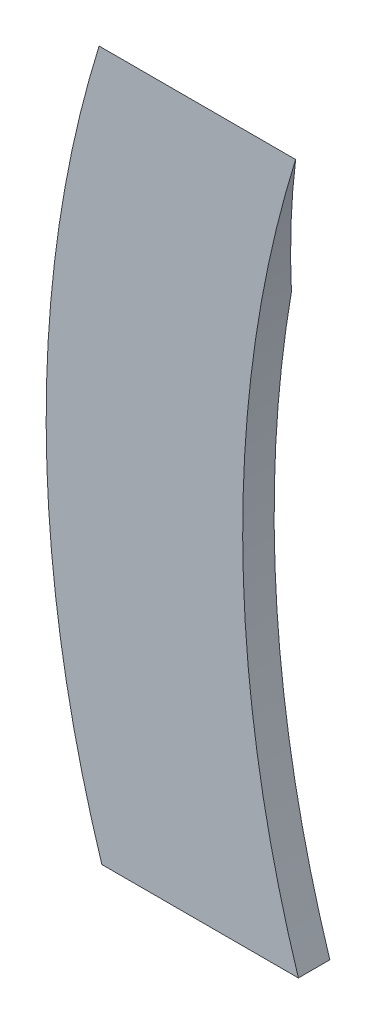
ISO-10303-21;
HEADER;
FILE_DESCRIPTION(('STEP AP214'),'2;1');
FILE_NAME('part.step','',(''),(''),'','','');
FILE_SCHEMA(('AUTOMOTIVE_DESIGN { 1 0 10303 214 1 1 1 1 }'));
ENDSEC;
DATA;
#1=APPLICATION_CONTEXT('core data for automotive mechanical design processes');
#2=APPLICATION_PROTOCOL_DEFINITION('international standard','automotive_design',2000,#1);
#3=PRODUCT_CONTEXT('',#1,'mechanical');
#4=PRODUCT('Part','Part','',(#3));
#5=PRODUCT_RELATED_PRODUCT_CATEGORY('part','',(#4));
#6=PRODUCT_DEFINITION_FORMATION('','',#4);
#7=PRODUCT_DEFINITION_CONTEXT('part definition',#1,'design');
#8=PRODUCT_DEFINITION('design','',#6,#7);
#9=PRODUCT_DEFINITION_SHAPE('','',#8);
#10=(LENGTH_UNIT() NAMED_UNIT(*) SI_UNIT(.MILLI.,.METRE.));
#11=(NAMED_UNIT(*) PLANE_ANGLE_UNIT() SI_UNIT($,.RADIAN.));
#12=(NAMED_UNIT(*) SI_UNIT($,.STERADIAN.) SOLID_ANGLE_UNIT());
#13=UNCERTAINTY_MEASURE_WITH_UNIT(LENGTH_MEASURE(1.E-05),#10,'distance_accuracy_value','');
#14=(GEOMETRIC_REPRESENTATION_CONTEXT(3) GLOBAL_UNCERTAINTY_ASSIGNED_CONTEXT((#13)) GLOBAL_UNIT_ASSIGNED_CONTEXT((#10,
#11,#12)) REPRESENTATION_CONTEXT('',''));
#15=CARTESIAN_POINT('',(0.,0.,0.));
#16=DIRECTION('',(0.,0.,1.));
#17=DIRECTION('',(1.,0.,0.));
#18=AXIS2_PLACEMENT_3D('',#15,#16,#17);
#19=CARTESIAN_POINT('',(142.914429491909,45.5572809000085,4.));
#20=DIRECTION('',(0.,0.,-1.));
#21=DIRECTION('',(-1.,0.,0.));
#22=AXIS2_PLACEMENT_3D('',#19,#20,#21);
#23=CYLINDRICAL_SURFACE('',#22,150.);
#24=CARTESIAN_POINT('',(142.914429491909,45.5572809000085,4.));
#25=DIRECTION('',(0.,0.,1.));
#26=DIRECTION('',(-1.,0.,0.));
#27=AXIS2_PLACEMENT_3D('',#24,#25,#26);
#28=CIRCLE('',#27,150.);
#29=CARTESIAN_POINT('',(-0.350516391581096,90.,4.));
#30=VERTEX_POINT('',#29);
#31=CARTESIAN_POINT('',(0.,0.,4.));
#32=VERTEX_POINT('',#31);
#33=EDGE_CURVE('E130',#30,#32,#28,.T.);
#34=ORIENTED_EDGE('',*,*,#33,.F.);
#35=CARTESIAN_POINT('',(142.914429491909,45.5572809000085,-5.44659156316052));
#36=DIRECTION('',(0.,-0.207911690817753,0.978147600733807));
#37=DIRECTION('',(0.,-0.978147600733807,-0.207911690817753));
#38=AXIS2_PLACEMENT_3D('',#35,#36,#37);
#39=ELLIPSE('',#38,153.351089229754,150.);
#40=CARTESIAN_POINT('',(-4.88070047835257,71.1814795620856,0.));
#41=VERTEX_POINT('',#40);
#42=EDGE_CURVE('E121',#30,#41,#39,.T.);
#43=ORIENTED_EDGE('',*,*,#42,.T.);
#44=CARTESIAN_POINT('',(142.914429491909,45.5572809000085,0.));
#45=DIRECTION('',(0.,0.,1.));
#46=DIRECTION('',(-1.,0.,0.));
#47=AXIS2_PLACEMENT_3D('',#44,#45,#46);
#48=CIRCLE('',#47,150.);
#49=CARTESIAN_POINT('',(0.,0.,0.));
#50=VERTEX_POINT('',#49);
#51=EDGE_CURVE('E129',#41,#50,#48,.T.);
#52=ORIENTED_EDGE('',*,*,#51,.T.);
#53=DIRECTION('',(0.,0.,-1.));
#54=VECTOR('',#53,1.);
#55=CARTESIAN_POINT('',(0.,0.,4.));
#56=LINE('',#55,#54);
#57=EDGE_CURVE('E150',#32,#50,#56,.T.);
#58=ORIENTED_EDGE('',*,*,#57,.F.);
#59=EDGE_LOOP('',(#34,#43,#52,#58));
#60=FACE_BOUND('',#59,.T.);
#61=CARTESIAN_POINT('',(142.914429491909,45.5572809000085,0.999999999999997));
#62=DIRECTION('',(0.,0.,1.));
#63=DIRECTION('',(0.,-1.,0.));
#64=AXIS2_PLACEMENT_3D('',#61,#62,#63);
#65=CIRCLE('',#64,150.);
#66=CARTESIAN_POINT('',(-5.08068354564714,70.,1.));
#67=VERTEX_POINT('',#66);
#68=CARTESIAN_POINT('',(-4.89228684059795,20.,0.999999999999994));
#69=VERTEX_POINT('',#68);
#70=EDGE_CURVE('E155',#67,#69,#65,.T.);
#71=ORIENTED_EDGE('',*,*,#70,.F.);
#72=DIRECTION('',(0.,0.,-1.));
#73=VECTOR('',#72,1.);
#74=CARTESIAN_POINT('',(-5.08068354564714,70.,4.));
#75=LINE('',#74,#73);
#76=CARTESIAN_POINT('',(-5.08068354564714,70.,3.));
#77=VERTEX_POINT('',#76);
#78=EDGE_CURVE('E11',#77,#67,#75,.T.);
#79=ORIENTED_EDGE('',*,*,#78,.F.);
#80=CARTESIAN_POINT('',(142.914429491909,45.5572809000085,3.));
#81=DIRECTION('',(0.,0.,-1.));
#82=DIRECTION('',(-1.,0.,0.));
#83=AXIS2_PLACEMENT_3D('',#80,#81,#82);
#84=CIRCLE('',#83,150.);
#85=CARTESIAN_POINT('',(-4.89228684059795,20.,3.));
#86=VERTEX_POINT('',#85);
#87=EDGE_CURVE('E43',#86,#77,#84,.T.);
#88=ORIENTED_EDGE('',*,*,#87,.F.);
#89=DIRECTION('',(0.,0.,-1.));
#90=VECTOR('',#89,1.);
#91=CARTESIAN_POINT('',(-4.89228684059795,20.,4.));
#92=LINE('',#91,#90);
#93=EDGE_CURVE('E118',#69,#86,#92,.F.);
#94=ORIENTED_EDGE('',*,*,#93,.F.);
#95=EDGE_LOOP('',(#71,#79,#88,#94));
#96=FACE_BOUND('',#95,.T.);
#97=ADVANCED_FACE('F36',(#60,#96),#23,.T.);
#98=CARTESIAN_POINT('',(0.,0.,4.));
#99=DIRECTION('',(0.,1.,0.));
#100=DIRECTION('',(0.,0.,1.));
#101=AXIS2_PLACEMENT_3D('',#98,#99,#100);
#102=PLANE('',#101);
#103=DIRECTION('',(1.,0.,0.));
#104=VECTOR('',#103,1.);
#105=CARTESIAN_POINT('',(0.,0.,0.));
#106=LINE('',#105,#104);
#107=CARTESIAN_POINT('',(25.,0.,0.));
#108=VERTEX_POINT('',#107);
#109=EDGE_CURVE('E144',#50,#108,#106,.T.);
#110=ORIENTED_EDGE('',*,*,#109,.T.);
#111=DIRECTION('',(0.,0.,-1.));
#112=VECTOR('',#111,1.);
#113=CARTESIAN_POINT('',(25.,0.,4.));
#114=LINE('',#113,#112);
#115=CARTESIAN_POINT('',(25.,0.,4.));
#116=VERTEX_POINT('',#115);
#117=EDGE_CURVE('E142',#116,#108,#114,.T.);
#118=ORIENTED_EDGE('',*,*,#117,.F.);
#119=DIRECTION('',(1.,0.,0.));
#120=VECTOR('',#119,1.);
#121=CARTESIAN_POINT('',(0.,0.,4.));
#122=LINE('',#121,#120);
#123=EDGE_CURVE('E133',#32,#116,#122,.T.);
#124=ORIENTED_EDGE('',*,*,#123,.F.);
#125=ORIENTED_EDGE('',*,*,#57,.T.);
#126=EDGE_LOOP('',(#110,#118,#124,#125));
#127=FACE_BOUND('',#126,.T.);
#128=ADVANCED_FACE('F178',(#127),#102,.F.);
#129=CARTESIAN_POINT('',(167.914429491909,45.5572809000085,4.));
#130=DIRECTION('',(0.,0.,-1.));
#131=DIRECTION('',(-1.,0.,0.));
#132=AXIS2_PLACEMENT_3D('',#129,#130,#131);
#133=CYLINDRICAL_SURFACE('',#132,150.);
#134=CARTESIAN_POINT('',(167.914429491909,45.5572809000085,0.));
#135=DIRECTION('',(0.,0.,-1.));
#136=DIRECTION('',(1.,0.,0.));
#137=AXIS2_PLACEMENT_3D('',#134,#135,#136);
#138=CIRCLE('',#137,150.);
#139=CARTESIAN_POINT('',(20.1192995216474,71.1814795620856,0.));
#140=VERTEX_POINT('',#139);
#141=EDGE_CURVE('E134',#108,#140,#138,.T.);
#142=ORIENTED_EDGE('',*,*,#141,.T.);
#143=CARTESIAN_POINT('',(167.914429491909,45.5572809000085,-5.44659156316052));
#144=DIRECTION('',(0.,-0.207911690817753,0.978147600733807));
#145=DIRECTION('',(0.,-0.978147600733807,-0.207911690817753));
#146=AXIS2_PLACEMENT_3D('',#143,#144,#145);
#147=ELLIPSE('',#146,153.351089229754,150.);
#148=CARTESIAN_POINT('',(24.6494836084189,90.,4.));
#149=VERTEX_POINT('',#148);
#150=EDGE_CURVE('E57',#140,#149,#147,.F.);
#151=ORIENTED_EDGE('',*,*,#150,.T.);
#152=CARTESIAN_POINT('',(167.914429491909,45.5572809000085,4.));
#153=DIRECTION('',(0.,0.,-1.));
#154=DIRECTION('',(1.,0.,0.));
#155=AXIS2_PLACEMENT_3D('',#152,#153,#154);
#156=CIRCLE('',#155,150.);
#157=EDGE_CURVE('E136',#116,#149,#156,.T.);
#158=ORIENTED_EDGE('',*,*,#157,.F.);
#159=ORIENTED_EDGE('',*,*,#117,.T.);
#160=EDGE_LOOP('',(#142,#151,#158,#159));
#161=FACE_BOUND('',#160,.T.);
#162=ADVANCED_FACE('F183',(#161),#133,.F.);
#163=CARTESIAN_POINT('',(142.914429491909,45.5572809000085,4.));
#164=DIRECTION('',(0.,0.,-1.));
#165=DIRECTION('',(-1.,0.,0.));
#166=AXIS2_PLACEMENT_3D('',#163,#164,#165);
#167=PLANE('',#166);
#168=ORIENTED_EDGE('',*,*,#33,.T.);
#169=ORIENTED_EDGE('',*,*,#123,.T.);
#170=ORIENTED_EDGE('',*,*,#157,.T.);
#171=DIRECTION('',(-1.,0.,0.));
#172=VECTOR('',#171,1.);
#173=CARTESIAN_POINT('',(-0.350516391581124,90.,4.));
#174=LINE('',#173,#172);
#175=EDGE_CURVE('E139',#149,#30,#174,.T.);
#176=ORIENTED_EDGE('',*,*,#175,.T.);
#177=EDGE_LOOP('',(#168,#169,#170,#176));
#178=FACE_BOUND('',#177,.T.);
#179=ADVANCED_FACE('F189',(#178),#167,.F.);
#180=CARTESIAN_POINT('',(142.914429491909,45.5572809000085,0.));
#181=DIRECTION('',(0.,0.,-1.));
#182=DIRECTION('',(-1.,0.,0.));
#183=AXIS2_PLACEMENT_3D('',#180,#181,#182);
#184=PLANE('',#183);
#185=DIRECTION('',(-1.,0.,0.));
#186=VECTOR('',#185,1.);
#187=CARTESIAN_POINT('',(142.914429491909,71.1814795620856,0.));
#188=LINE('',#187,#186);
#189=EDGE_CURVE('E153',#140,#41,#188,.T.);
#190=ORIENTED_EDGE('',*,*,#189,.F.);
#191=ORIENTED_EDGE('',*,*,#141,.F.);
#192=ORIENTED_EDGE('',*,*,#109,.F.);
#193=ORIENTED_EDGE('',*,*,#51,.F.);
#194=EDGE_LOOP('',(#190,#191,#192,#193));
#195=FACE_BOUND('',#194,.T.);
#196=ADVANCED_FACE('F197',(#195),#184,.T.);
#197=CARTESIAN_POINT('',(-7.08557050809139,90.,4.));
#198=DIRECTION('',(0.,-0.207911690817753,0.978147600733807));
#199=DIRECTION('',(0.,-0.978147600733807,-0.207911690817753));
#200=AXIS2_PLACEMENT_3D('',#197,#198,#199);
#201=PLANE('',#200);
#202=ORIENTED_EDGE('',*,*,#175,.F.);
#203=ORIENTED_EDGE('',*,*,#150,.F.);
#204=ORIENTED_EDGE('',*,*,#189,.T.);
#205=ORIENTED_EDGE('',*,*,#42,.F.);
#206=EDGE_LOOP('',(#202,#203,#204,#205));
#207=FACE_BOUND('',#206,.T.);
#208=ADVANCED_FACE('F192',(#207),#201,.F.);
#209=CARTESIAN_POINT('',(12.,20.,3.));
#210=DIRECTION('',(0.,0.,-1.));
#211=DIRECTION('',(-1.,0.,0.));
#212=AXIS2_PLACEMENT_3D('',#209,#210,#211);
#213=PLANE('',#212);
#214=ORIENTED_EDGE('',*,*,#87,.T.);
#215=DIRECTION('',(-1.,0.,0.));
#216=VECTOR('',#215,1.);
#217=CARTESIAN_POINT('',(12.,70.,3.));
#218=LINE('',#217,#216);
#219=CARTESIAN_POINT('',(12.,70.,3.));
#220=VERTEX_POINT('',#219);
#221=EDGE_CURVE('E114',#220,#77,#218,.T.);
#222=ORIENTED_EDGE('',*,*,#221,.F.);
#223=DIRECTION('',(0.,-1.,0.));
#224=VECTOR('',#223,1.);
#225=CARTESIAN_POINT('',(12.,20.,3.));
#226=LINE('',#225,#224);
#227=CARTESIAN_POINT('',(12.,20.,3.));
#228=VERTEX_POINT('',#227);
#229=EDGE_CURVE('E105',#220,#228,#226,.T.);
#230=ORIENTED_EDGE('',*,*,#229,.T.);
#231=DIRECTION('',(-1.,0.,0.));
#232=VECTOR('',#231,1.);
#233=CARTESIAN_POINT('',(12.,20.,3.));
#234=LINE('',#233,#232);
#235=EDGE_CURVE('E113',#228,#86,#234,.T.);
#236=ORIENTED_EDGE('',*,*,#235,.T.);
#237=EDGE_LOOP('',(#214,#222,#230,#236));
#238=FACE_BOUND('',#237,.T.);
#239=ADVANCED_FACE('F112',(#238),#213,.T.);
#240=CARTESIAN_POINT('',(12.,20.,0.999999999999994));
#241=DIRECTION('',(0.,1.,0.));
#242=DIRECTION('',(0.,0.,1.));
#243=AXIS2_PLACEMENT_3D('',#240,#241,#242);
#244=PLANE('',#243);
#245=ORIENTED_EDGE('',*,*,#93,.T.);
#246=ORIENTED_EDGE('',*,*,#235,.F.);
#247=DIRECTION('',(0.,0.,-1.));
#248=VECTOR('',#247,1.);
#249=CARTESIAN_POINT('',(12.,20.,0.999999999999994));
#250=LINE('',#249,#248);
#251=CARTESIAN_POINT('',(12.,20.,0.999999999999994));
#252=VERTEX_POINT('',#251);
#253=EDGE_CURVE('E101',#228,#252,#250,.T.);
#254=ORIENTED_EDGE('',*,*,#253,.T.);
#255=DIRECTION('',(-1.,0.,0.));
#256=VECTOR('',#255,1.);
#257=CARTESIAN_POINT('',(12.,20.,0.999999999999994));
#258=LINE('',#257,#256);
#259=EDGE_CURVE('E119',#252,#69,#258,.T.);
#260=ORIENTED_EDGE('',*,*,#259,.T.);
#261=EDGE_LOOP('',(#245,#246,#254,#260));
#262=FACE_BOUND('',#261,.T.);
#263=ADVANCED_FACE('F116',(#262),#244,.T.);
#264=CARTESIAN_POINT('',(12.,70.,1.));
#265=DIRECTION('',(0.,0.,1.));
#266=DIRECTION('',(0.,-1.,0.));
#267=AXIS2_PLACEMENT_3D('',#264,#265,#266);
#268=PLANE('',#267);
#269=DIRECTION('',(-1.,0.,0.));
#270=VECTOR('',#269,1.);
#271=CARTESIAN_POINT('',(12.,70.,1.));
#272=LINE('',#271,#270);
#273=CARTESIAN_POINT('',(12.,70.,1.));
#274=VERTEX_POINT('',#273);
#275=EDGE_CURVE('E123',#274,#67,#272,.T.);
#276=ORIENTED_EDGE('',*,*,#275,.T.);
#277=ORIENTED_EDGE('',*,*,#70,.T.);
#278=ORIENTED_EDGE('',*,*,#259,.F.);
#279=DIRECTION('',(0.,1.,0.));
#280=VECTOR('',#279,1.);
#281=CARTESIAN_POINT('',(12.,70.,1.));
#282=LINE('',#281,#280);
#283=EDGE_CURVE('E106',#252,#274,#282,.T.);
#284=ORIENTED_EDGE('',*,*,#283,.T.);
#285=EDGE_LOOP('',(#276,#277,#278,#284));
#286=FACE_BOUND('',#285,.T.);
#287=ADVANCED_FACE('F159',(#286),#268,.T.);
#288=CARTESIAN_POINT('',(12.,70.,3.));
#289=DIRECTION('',(0.,-1.,0.));
#290=DIRECTION('',(0.,0.,-1.));
#291=AXIS2_PLACEMENT_3D('',#288,#289,#290);
#292=PLANE('',#291);
#293=ORIENTED_EDGE('',*,*,#78,.T.);
#294=ORIENTED_EDGE('',*,*,#275,.F.);
#295=DIRECTION('',(0.,0.,1.));
#296=VECTOR('',#295,1.);
#297=CARTESIAN_POINT('',(12.,70.,3.));
#298=LINE('',#297,#296);
#299=EDGE_CURVE('E165',#274,#220,#298,.T.);
#300=ORIENTED_EDGE('',*,*,#299,.T.);
#301=ORIENTED_EDGE('',*,*,#221,.T.);
#302=EDGE_LOOP('',(#293,#294,#300,#301));
#303=FACE_BOUND('',#302,.T.);
#304=ADVANCED_FACE('F164',(#303),#292,.T.);
#305=CARTESIAN_POINT('',(12.,0.,0.));
#306=DIRECTION('',(-1.,0.,0.));
#307=DIRECTION('',(0.,0.,1.));
#308=AXIS2_PLACEMENT_3D('',#305,#306,#307);
#309=PLANE('',#308);
#310=ORIENTED_EDGE('',*,*,#229,.F.);
#311=ORIENTED_EDGE('',*,*,#299,.F.);
#312=ORIENTED_EDGE('',*,*,#283,.F.);
#313=ORIENTED_EDGE('',*,*,#253,.F.);
#314=EDGE_LOOP('',(#310,#311,#312,#313));
#315=FACE_BOUND('',#314,.T.);
#316=ADVANCED_FACE('F103',(#315),#309,.T.);
#317=CLOSED_SHELL('',(#97,#128,#162,#179,#196,#208,#239,#263,#287,#304,#316));
#318=MANIFOLD_SOLID_BREP('B2',#317);
#319=ADVANCED_BREP_SHAPE_REPRESENTATION('',(#18,#318),#14);
#320=SHAPE_DEFINITION_REPRESENTATION(#9,#319);
ENDSEC;
END-ISO-10303-21;
